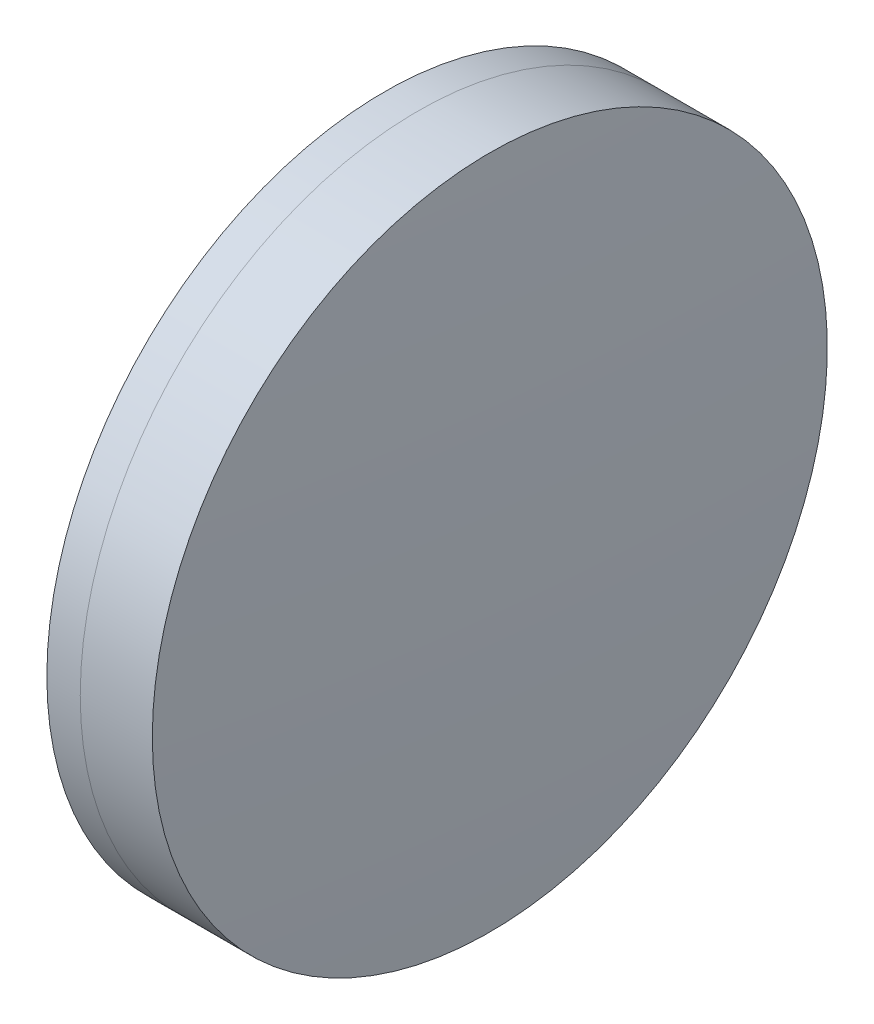
ISO-10303-21;
HEADER;
FILE_DESCRIPTION(('STEP AP214'),'2;1');
FILE_NAME('part.step','',(''),(''),'','','');
FILE_SCHEMA(('AUTOMOTIVE_DESIGN { 1 0 10303 214 1 1 1 1 }'));
ENDSEC;
DATA;
#1=APPLICATION_CONTEXT('core data for automotive mechanical design processes');
#2=APPLICATION_PROTOCOL_DEFINITION('international standard','automotive_design',2000,#1);
#3=PRODUCT_CONTEXT('',#1,'mechanical');
#4=PRODUCT('Part','Part','',(#3));
#5=PRODUCT_RELATED_PRODUCT_CATEGORY('part','',(#4));
#6=PRODUCT_DEFINITION_FORMATION('','',#4);
#7=PRODUCT_DEFINITION_CONTEXT('part definition',#1,'design');
#8=PRODUCT_DEFINITION('design','',#6,#7);
#9=PRODUCT_DEFINITION_SHAPE('','',#8);
#10=(LENGTH_UNIT() NAMED_UNIT(*) SI_UNIT(.MILLI.,.METRE.));
#11=(NAMED_UNIT(*) PLANE_ANGLE_UNIT() SI_UNIT($,.RADIAN.));
#12=(NAMED_UNIT(*) SI_UNIT($,.STERADIAN.) SOLID_ANGLE_UNIT());
#13=UNCERTAINTY_MEASURE_WITH_UNIT(LENGTH_MEASURE(1.E-05),#10,'distance_accuracy_value','');
#14=(GEOMETRIC_REPRESENTATION_CONTEXT(3) GLOBAL_UNCERTAINTY_ASSIGNED_CONTEXT((#13)) GLOBAL_UNIT_ASSIGNED_CONTEXT((#10,
#11,#12)) REPRESENTATION_CONTEXT('',''));
#15=CARTESIAN_POINT('',(0.,0.,0.));
#16=DIRECTION('',(0.,0.,1.));
#17=DIRECTION('',(1.,0.,0.));
#18=AXIS2_PLACEMENT_3D('',#15,#16,#17);
#19=CARTESIAN_POINT('',(250.000125938113,0.,0.));
#20=DIRECTION('',(-1.,0.,0.));
#21=DIRECTION('',(0.,0.,1.));
#22=AXIS2_PLACEMENT_3D('',#19,#20,#21);
#23=SPHERICAL_SURFACE('',#22,53.7);
#24=CARTESIAN_POINT('',(302.176749056134,0.,0.));
#25=DIRECTION('',(-1.,0.,0.));
#26=DIRECTION('',(0.,0.,1.));
#27=AXIS2_PLACEMENT_3D('',#24,#25,#26);
#28=CIRCLE('',#27,12.7);
#29=CARTESIAN_POINT('',(302.176749056134,0.,12.7));
#30=VERTEX_POINT('',#29);
#31=EDGE_CURVE('E11',#30,#30,#28,.T.);
#32=ORIENTED_EDGE('',*,*,#31,.T.);
#33=EDGE_LOOP('',(#32));
#34=FACE_BOUND('',#33,.T.);
#35=ADVANCED_FACE('F45',(#34),#23,.F.);
#36=CARTESIAN_POINT('',(-0.551919992657797,0.,0.));
#37=DIRECTION('',(-1.,0.,0.));
#38=DIRECTION('',(0.,0.,1.));
#39=AXIS2_PLACEMENT_3D('',#36,#37,#38);
#40=CYLINDRICAL_SURFACE('',#39,12.7);
#41=CARTESIAN_POINT('',(304.889060903118,0.,0.));
#42=DIRECTION('',(-1.,0.,0.));
#43=DIRECTION('',(0.,0.,1.));
#44=AXIS2_PLACEMENT_3D('',#41,#42,#43);
#45=CIRCLE('',#44,12.7);
#46=CARTESIAN_POINT('',(304.889060903118,0.,12.7));
#47=VERTEX_POINT('',#46);
#48=EDGE_CURVE('E51',#47,#47,#45,.T.);
#49=ORIENTED_EDGE('',*,*,#48,.T.);
#50=EDGE_LOOP('',(#49));
#51=FACE_BOUND('',#50,.T.);
#52=ORIENTED_EDGE('',*,*,#31,.F.);
#53=EDGE_LOOP('',(#52));
#54=FACE_BOUND('',#53,.T.);
#55=ADVANCED_FACE('F57',(#51,#54),#40,.T.);
#56=CARTESIAN_POINT('',(45.7901259381128,0.,0.));
#57=DIRECTION('',(-1.,0.,0.));
#58=DIRECTION('',(0.,0.,1.));
#59=AXIS2_PLACEMENT_3D('',#56,#57,#58);
#60=SPHERICAL_SURFACE('',#59,259.41);
#61=ORIENTED_EDGE('',*,*,#48,.F.);
#62=EDGE_LOOP('',(#61));
#63=FACE_BOUND('',#62,.T.);
#64=ADVANCED_FACE('F60',(#63),#60,.T.);
#65=CLOSED_SHELL('',(#35,#55,#64));
#66=MANIFOLD_SOLID_BREP('B2',#65);
#67=CARTESIAN_POINT('',(366.380125938113,0.,0.));
#68=DIRECTION('',(-1.,0.,0.));
#69=DIRECTION('',(0.,0.,-1.));
#70=AXIS2_PLACEMENT_3D('',#67,#68,#69);
#71=SPHERICAL_SURFACE('',#70,66.68);
#72=CARTESIAN_POINT('',(300.920730890496,0.,0.));
#73=DIRECTION('',(-1.,0.,0.));
#74=DIRECTION('',(0.,0.,1.));
#75=AXIS2_PLACEMENT_3D('',#72,#73,#74);
#76=CIRCLE('',#75,12.7);
#77=CARTESIAN_POINT('',(300.920730890496,0.,12.7));
#78=VERTEX_POINT('',#77);
#79=EDGE_CURVE('E44',#78,#78,#76,.T.);
#80=ORIENTED_EDGE('',*,*,#79,.T.);
#81=EDGE_LOOP('',(#80));
#82=FACE_BOUND('',#81,.T.);
#83=ADVANCED_FACE('F86',(#82),#71,.T.);
#84=CARTESIAN_POINT('',(124.523309526045,0.,0.));
#85=DIRECTION('',(-1.,0.,0.));
#86=DIRECTION('',(0.,0.,1.));
#87=AXIS2_PLACEMENT_3D('',#84,#85,#86);
#88=CYLINDRICAL_SURFACE('',#87,12.7);
#89=CARTESIAN_POINT('',(302.176749056134,0.,0.));
#90=DIRECTION('',(-1.,0.,0.));
#91=DIRECTION('',(0.,0.,1.));
#92=AXIS2_PLACEMENT_3D('',#89,#90,#91);
#93=CIRCLE('',#92,12.7);
#94=CARTESIAN_POINT('',(302.176749056134,0.,12.7));
#95=VERTEX_POINT('',#94);
#96=EDGE_CURVE('E92',#95,#95,#93,.T.);
#97=ORIENTED_EDGE('',*,*,#96,.T.);
#98=EDGE_LOOP('',(#97));
#99=FACE_BOUND('',#98,.T.);
#100=ORIENTED_EDGE('',*,*,#79,.F.);
#101=EDGE_LOOP('',(#100));
#102=FACE_BOUND('',#101,.T.);
#103=ADVANCED_FACE('F98',(#99,#102),#88,.T.);
#104=CARTESIAN_POINT('',(250.000125938113,0.,0.));
#105=DIRECTION('',(-1.,0.,0.));
#106=DIRECTION('',(0.,0.,1.));
#107=AXIS2_PLACEMENT_3D('',#104,#105,#106);
#108=SPHERICAL_SURFACE('',#107,53.7);
#109=ORIENTED_EDGE('',*,*,#96,.F.);
#110=EDGE_LOOP('',(#109));
#111=FACE_BOUND('',#110,.T.);
#112=ADVANCED_FACE('F101',(#111),#108,.T.);
#113=CLOSED_SHELL('',(#83,#103,#112));
#114=MANIFOLD_SOLID_BREP('B6',#113);
#115=ADVANCED_BREP_SHAPE_REPRESENTATION('',(#18,#66,#114),#14);
#116=SHAPE_DEFINITION_REPRESENTATION(#9,#115);
ENDSEC;
END-ISO-10303-21;
